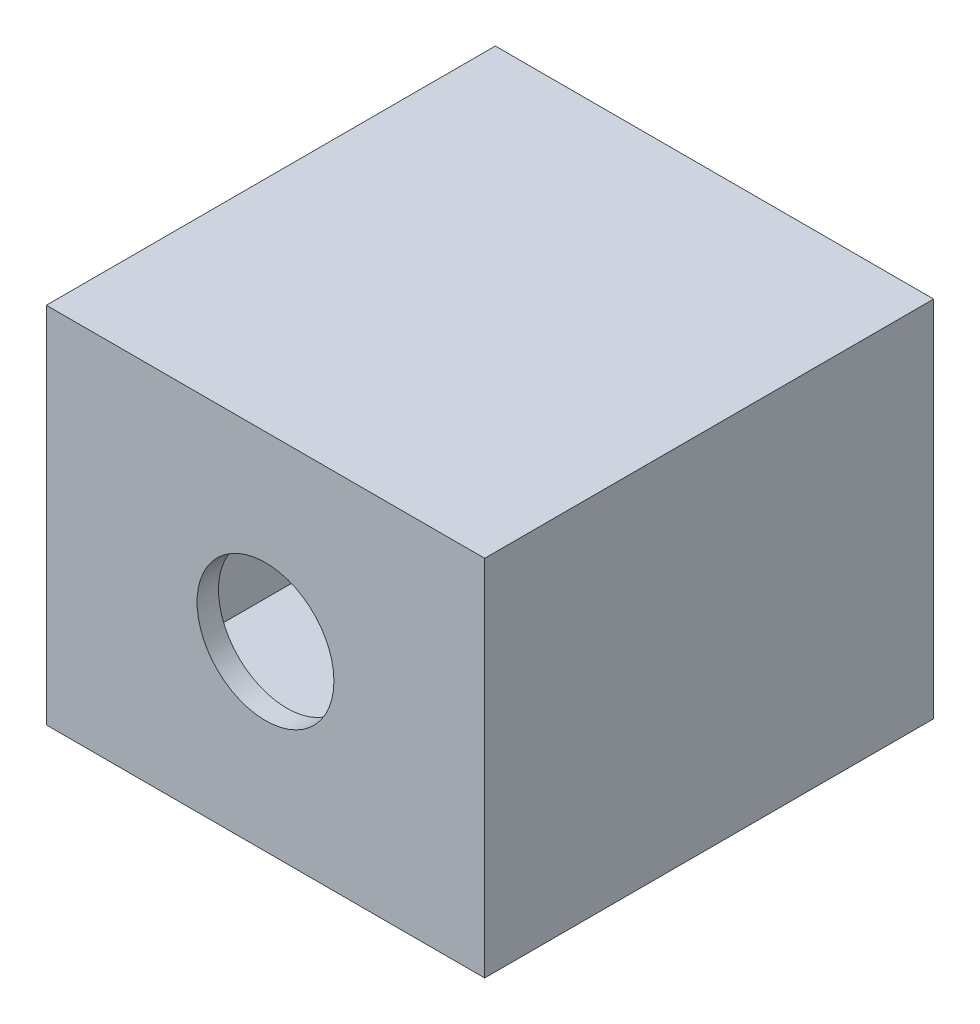
ISO-10303-21;
HEADER;
FILE_DESCRIPTION(('STEP AP214'),'2;1');
FILE_NAME('part.step','',(''),(''),'','','');
FILE_SCHEMA(('AUTOMOTIVE_DESIGN { 1 0 10303 214 1 1 1 1 }'));
ENDSEC;
DATA;
#1=APPLICATION_CONTEXT('core data for automotive mechanical design processes');
#2=APPLICATION_PROTOCOL_DEFINITION('international standard','automotive_design',2000,#1);
#3=PRODUCT_CONTEXT('',#1,'mechanical');
#4=PRODUCT('Part','Part','',(#3));
#5=PRODUCT_RELATED_PRODUCT_CATEGORY('part','',(#4));
#6=PRODUCT_DEFINITION_FORMATION('','',#4);
#7=PRODUCT_DEFINITION_CONTEXT('part definition',#1,'design');
#8=PRODUCT_DEFINITION('design','',#6,#7);
#9=PRODUCT_DEFINITION_SHAPE('','',#8);
#10=(LENGTH_UNIT() NAMED_UNIT(*) SI_UNIT(.MILLI.,.METRE.));
#11=(NAMED_UNIT(*) PLANE_ANGLE_UNIT() SI_UNIT($,.RADIAN.));
#12=(NAMED_UNIT(*) SI_UNIT($,.STERADIAN.) SOLID_ANGLE_UNIT());
#13=UNCERTAINTY_MEASURE_WITH_UNIT(LENGTH_MEASURE(1.E-05),#10,'distance_accuracy_value','');
#14=(GEOMETRIC_REPRESENTATION_CONTEXT(3) GLOBAL_UNCERTAINTY_ASSIGNED_CONTEXT((#13)) GLOBAL_UNIT_ASSIGNED_CONTEXT((#10,
#11,#12)) REPRESENTATION_CONTEXT('',''));
#15=CARTESIAN_POINT('',(0.,0.,0.));
#16=DIRECTION('',(0.,0.,1.));
#17=DIRECTION('',(1.,0.,0.));
#18=AXIS2_PLACEMENT_3D('',#15,#16,#17);
#19=CARTESIAN_POINT('',(0.,0.,0.));
#20=DIRECTION('',(0.,0.,1.));
#21=DIRECTION('',(1.,0.,0.));
#22=AXIS2_PLACEMENT_3D('',#19,#20,#21);
#23=PLANE('',#22);
#24=DIRECTION('',(0.,-1.,0.));
#25=VECTOR('',#24,1.);
#26=CARTESIAN_POINT('',(-50.0512204159946,12.5345616141394,0.));
#27=LINE('',#26,#25);
#28=CARTESIAN_POINT('',(-50.0512204159946,12.5345616141394,0.));
#29=VERTEX_POINT('',#28);
#30=CARTESIAN_POINT('',(-50.0512204159946,-4.46543838586062,0.));
#31=VERTEX_POINT('',#30);
#32=EDGE_CURVE('E105',#29,#31,#27,.T.);
#33=ORIENTED_EDGE('',*,*,#32,.F.);
#34=DIRECTION('',(-1.,0.,0.));
#35=VECTOR('',#34,1.);
#36=CARTESIAN_POINT('',(-50.0512204159946,12.5345616141394,0.));
#37=LINE('',#36,#35);
#38=CARTESIAN_POINT('',(-29.5512204159946,12.5345616141394,0.));
#39=VERTEX_POINT('',#38);
#40=EDGE_CURVE('E56',#39,#29,#37,.T.);
#41=ORIENTED_EDGE('',*,*,#40,.F.);
#42=DIRECTION('',(0.,1.,0.));
#43=VECTOR('',#42,1.);
#44=CARTESIAN_POINT('',(-29.5512204159946,12.5345616141394,0.));
#45=LINE('',#44,#43);
#46=CARTESIAN_POINT('',(-29.5512204159946,-4.46543838586062,0.));
#47=VERTEX_POINT('',#46);
#48=EDGE_CURVE('E163',#47,#39,#45,.T.);
#49=ORIENTED_EDGE('',*,*,#48,.F.);
#50=DIRECTION('',(1.,0.,0.));
#51=VECTOR('',#50,1.);
#52=CARTESIAN_POINT('',(-50.0512204159946,-4.46543838586062,0.));
#53=LINE('',#52,#51);
#54=EDGE_CURVE('E161',#31,#47,#53,.T.);
#55=ORIENTED_EDGE('',*,*,#54,.F.);
#56=EDGE_LOOP('',(#33,#41,#49,#55));
#57=FACE_BOUND('',#56,.T.);
#58=DIRECTION('',(0.,-1.,0.));
#59=VECTOR('',#58,1.);
#60=CARTESIAN_POINT('',(-49.0512204159946,11.5345616141394,0.));
#61=LINE('',#60,#59);
#62=CARTESIAN_POINT('',(-49.0512204159946,11.5345616141394,0.));
#63=VERTEX_POINT('',#62);
#64=CARTESIAN_POINT('',(-49.0512204159946,-3.46543838586062,0.));
#65=VERTEX_POINT('',#64);
#66=EDGE_CURVE('E48',#63,#65,#61,.T.);
#67=ORIENTED_EDGE('',*,*,#66,.T.);
#68=DIRECTION('',(1.,0.,0.));
#69=VECTOR('',#68,1.);
#70=CARTESIAN_POINT('',(-49.0512204159946,-3.46543838586062,0.));
#71=LINE('',#70,#69);
#72=CARTESIAN_POINT('',(-30.5512204159946,-3.46543838586062,0.));
#73=VERTEX_POINT('',#72);
#74=EDGE_CURVE('E145',#65,#73,#71,.T.);
#75=ORIENTED_EDGE('',*,*,#74,.T.);
#76=DIRECTION('',(0.,1.,0.));
#77=VECTOR('',#76,1.);
#78=CARTESIAN_POINT('',(-30.5512204159946,11.5345616141394,0.));
#79=LINE('',#78,#77);
#80=CARTESIAN_POINT('',(-30.5512204159946,11.5345616141394,0.));
#81=VERTEX_POINT('',#80);
#82=EDGE_CURVE('E148',#73,#81,#79,.T.);
#83=ORIENTED_EDGE('',*,*,#82,.T.);
#84=DIRECTION('',(-1.,0.,0.));
#85=VECTOR('',#84,1.);
#86=CARTESIAN_POINT('',(-49.0512204159946,11.5345616141394,0.));
#87=LINE('',#86,#85);
#88=EDGE_CURVE('E134',#81,#63,#87,.T.);
#89=ORIENTED_EDGE('',*,*,#88,.T.);
#90=EDGE_LOOP('',(#67,#75,#83,#89));
#91=FACE_BOUND('',#90,.T.);
#92=ADVANCED_FACE('F33',(#57,#91),#23,.F.);
#93=CARTESIAN_POINT('',(-50.0512204159946,12.5345616141394,20.));
#94=DIRECTION('',(1.,0.,0.));
#95=DIRECTION('',(0.,0.,-1.));
#96=AXIS2_PLACEMENT_3D('',#93,#94,#95);
#97=PLANE('',#96);
#98=ORIENTED_EDGE('',*,*,#32,.T.);
#99=DIRECTION('',(0.,0.,-1.));
#100=VECTOR('',#99,1.);
#101=CARTESIAN_POINT('',(-50.0512204159946,-4.46543838586062,20.));
#102=LINE('',#101,#100);
#103=CARTESIAN_POINT('',(-50.0512204159946,-4.46543838586062,21.));
#104=VERTEX_POINT('',#103);
#105=EDGE_CURVE('E11',#104,#31,#102,.T.);
#106=ORIENTED_EDGE('',*,*,#105,.F.);
#107=DIRECTION('',(0.,-1.,0.));
#108=VECTOR('',#107,1.);
#109=CARTESIAN_POINT('',(-50.0512204159946,12.5345616141394,21.));
#110=LINE('',#109,#108);
#111=CARTESIAN_POINT('',(-50.0512204159946,12.5345616141394,21.));
#112=VERTEX_POINT('',#111);
#113=EDGE_CURVE('E103',#112,#104,#110,.T.);
#114=ORIENTED_EDGE('',*,*,#113,.F.);
#115=DIRECTION('',(0.,0.,-1.));
#116=VECTOR('',#115,1.);
#117=CARTESIAN_POINT('',(-50.0512204159946,12.5345616141394,20.));
#118=LINE('',#117,#116);
#119=EDGE_CURVE('E166',#112,#29,#118,.T.);
#120=ORIENTED_EDGE('',*,*,#119,.T.);
#121=EDGE_LOOP('',(#98,#106,#114,#120));
#122=FACE_BOUND('',#121,.T.);
#123=ADVANCED_FACE('F35',(#122),#97,.F.);
#124=CARTESIAN_POINT('',(-50.0512204159946,-4.46543838586062,20.));
#125=DIRECTION('',(0.,1.,0.));
#126=DIRECTION('',(0.,0.,1.));
#127=AXIS2_PLACEMENT_3D('',#124,#125,#126);
#128=PLANE('',#127);
#129=ORIENTED_EDGE('',*,*,#54,.T.);
#130=DIRECTION('',(0.,0.,-1.));
#131=VECTOR('',#130,1.);
#132=CARTESIAN_POINT('',(-29.5512204159946,-4.46543838586062,20.));
#133=LINE('',#132,#131);
#134=CARTESIAN_POINT('',(-29.5512204159946,-4.46543838586062,21.));
#135=VERTEX_POINT('',#134);
#136=EDGE_CURVE('E41',#135,#47,#133,.T.);
#137=ORIENTED_EDGE('',*,*,#136,.F.);
#138=DIRECTION('',(1.,0.,0.));
#139=VECTOR('',#138,1.);
#140=CARTESIAN_POINT('',(-50.0512204159946,-4.46543838586062,21.));
#141=LINE('',#140,#139);
#142=EDGE_CURVE('E108',#104,#135,#141,.T.);
#143=ORIENTED_EDGE('',*,*,#142,.F.);
#144=ORIENTED_EDGE('',*,*,#105,.T.);
#145=EDGE_LOOP('',(#129,#137,#143,#144));
#146=FACE_BOUND('',#145,.T.);
#147=ADVANCED_FACE('F109',(#146),#128,.F.);
#148=CARTESIAN_POINT('',(-29.5512204159946,12.5345616141394,20.));
#149=DIRECTION('',(-1.,0.,0.));
#150=DIRECTION('',(0.,-1.,0.));
#151=AXIS2_PLACEMENT_3D('',#148,#149,#150);
#152=PLANE('',#151);
#153=ORIENTED_EDGE('',*,*,#48,.T.);
#154=DIRECTION('',(0.,0.,-1.));
#155=VECTOR('',#154,1.);
#156=CARTESIAN_POINT('',(-29.5512204159946,12.5345616141394,20.));
#157=LINE('',#156,#155);
#158=CARTESIAN_POINT('',(-29.5512204159946,12.5345616141394,21.));
#159=VERTEX_POINT('',#158);
#160=EDGE_CURVE('E168',#159,#39,#157,.T.);
#161=ORIENTED_EDGE('',*,*,#160,.F.);
#162=DIRECTION('',(0.,1.,0.));
#163=VECTOR('',#162,1.);
#164=CARTESIAN_POINT('',(-29.5512204159946,12.5345616141394,21.));
#165=LINE('',#164,#163);
#166=EDGE_CURVE('E114',#135,#159,#165,.T.);
#167=ORIENTED_EDGE('',*,*,#166,.F.);
#168=ORIENTED_EDGE('',*,*,#136,.T.);
#169=EDGE_LOOP('',(#153,#161,#167,#168));
#170=FACE_BOUND('',#169,.T.);
#171=ADVANCED_FACE('F171',(#170),#152,.F.);
#172=CARTESIAN_POINT('',(-50.0512204159946,12.5345616141394,20.));
#173=DIRECTION('',(0.,-1.,0.));
#174=DIRECTION('',(1.,0.,0.));
#175=AXIS2_PLACEMENT_3D('',#172,#173,#174);
#176=PLANE('',#175);
#177=ORIENTED_EDGE('',*,*,#40,.T.);
#178=ORIENTED_EDGE('',*,*,#119,.F.);
#179=DIRECTION('',(-1.,0.,0.));
#180=VECTOR('',#179,1.);
#181=CARTESIAN_POINT('',(-50.0512204159946,12.5345616141394,21.));
#182=LINE('',#181,#180);
#183=EDGE_CURVE('E120',#159,#112,#182,.T.);
#184=ORIENTED_EDGE('',*,*,#183,.F.);
#185=ORIENTED_EDGE('',*,*,#160,.T.);
#186=EDGE_LOOP('',(#177,#178,#184,#185));
#187=FACE_BOUND('',#186,.T.);
#188=ADVANCED_FACE('F212',(#187),#176,.F.);
#189=CARTESIAN_POINT('',(-49.0512204159946,11.5345616141394,20.));
#190=DIRECTION('',(1.,0.,0.));
#191=DIRECTION('',(0.,0.,-1.));
#192=AXIS2_PLACEMENT_3D('',#189,#190,#191);
#193=PLANE('',#192);
#194=ORIENTED_EDGE('',*,*,#66,.F.);
#195=DIRECTION('',(0.,0.,-1.));
#196=VECTOR('',#195,1.);
#197=CARTESIAN_POINT('',(-49.0512204159946,11.5345616141394,20.));
#198=LINE('',#197,#196);
#199=CARTESIAN_POINT('',(-49.0512204159946,11.5345616141394,20.));
#200=VERTEX_POINT('',#199);
#201=EDGE_CURVE('E143',#200,#63,#198,.T.);
#202=ORIENTED_EDGE('',*,*,#201,.F.);
#203=DIRECTION('',(0.,-1.,0.));
#204=VECTOR('',#203,1.);
#205=CARTESIAN_POINT('',(-49.0512204159946,11.5345616141394,20.));
#206=LINE('',#205,#204);
#207=CARTESIAN_POINT('',(-49.0512204159946,-3.46543838586062,20.));
#208=VERTEX_POINT('',#207);
#209=EDGE_CURVE('E130',#200,#208,#206,.T.);
#210=ORIENTED_EDGE('',*,*,#209,.T.);
#211=DIRECTION('',(0.,0.,-1.));
#212=VECTOR('',#211,1.);
#213=CARTESIAN_POINT('',(-49.0512204159946,-3.46543838586062,20.));
#214=LINE('',#213,#212);
#215=EDGE_CURVE('E158',#208,#65,#214,.T.);
#216=ORIENTED_EDGE('',*,*,#215,.T.);
#217=EDGE_LOOP('',(#194,#202,#210,#216));
#218=FACE_BOUND('',#217,.T.);
#219=ADVANCED_FACE('F181',(#218),#193,.T.);
#220=CARTESIAN_POINT('',(-49.0512204159946,-3.46543838586062,20.));
#221=DIRECTION('',(0.,1.,0.));
#222=DIRECTION('',(-1.,0.,0.));
#223=AXIS2_PLACEMENT_3D('',#220,#221,#222);
#224=PLANE('',#223);
#225=ORIENTED_EDGE('',*,*,#74,.F.);
#226=ORIENTED_EDGE('',*,*,#215,.F.);
#227=DIRECTION('',(1.,0.,0.));
#228=VECTOR('',#227,1.);
#229=CARTESIAN_POINT('',(-49.0512204159946,-3.46543838586062,20.));
#230=LINE('',#229,#228);
#231=CARTESIAN_POINT('',(-30.5512204159946,-3.46543838586062,20.));
#232=VERTEX_POINT('',#231);
#233=EDGE_CURVE('E133',#208,#232,#230,.T.);
#234=ORIENTED_EDGE('',*,*,#233,.T.);
#235=DIRECTION('',(0.,0.,-1.));
#236=VECTOR('',#235,1.);
#237=CARTESIAN_POINT('',(-30.5512204159946,-3.46543838586062,20.));
#238=LINE('',#237,#236);
#239=EDGE_CURVE('E156',#232,#73,#238,.T.);
#240=ORIENTED_EDGE('',*,*,#239,.T.);
#241=EDGE_LOOP('',(#225,#226,#234,#240));
#242=FACE_BOUND('',#241,.T.);
#243=ADVANCED_FACE('F185',(#242),#224,.T.);
#244=CARTESIAN_POINT('',(-30.5512204159946,11.5345616141394,20.));
#245=DIRECTION('',(-1.,0.,0.));
#246=DIRECTION('',(0.,-1.,0.));
#247=AXIS2_PLACEMENT_3D('',#244,#245,#246);
#248=PLANE('',#247);
#249=ORIENTED_EDGE('',*,*,#82,.F.);
#250=ORIENTED_EDGE('',*,*,#239,.F.);
#251=DIRECTION('',(0.,1.,0.));
#252=VECTOR('',#251,1.);
#253=CARTESIAN_POINT('',(-30.5512204159946,11.5345616141394,20.));
#254=LINE('',#253,#252);
#255=CARTESIAN_POINT('',(-30.5512204159946,11.5345616141394,20.));
#256=VERTEX_POINT('',#255);
#257=EDGE_CURVE('E137',#232,#256,#254,.T.);
#258=ORIENTED_EDGE('',*,*,#257,.T.);
#259=DIRECTION('',(0.,0.,-1.));
#260=VECTOR('',#259,1.);
#261=CARTESIAN_POINT('',(-30.5512204159946,11.5345616141394,20.));
#262=LINE('',#261,#260);
#263=EDGE_CURVE('E154',#256,#81,#262,.T.);
#264=ORIENTED_EDGE('',*,*,#263,.T.);
#265=EDGE_LOOP('',(#249,#250,#258,#264));
#266=FACE_BOUND('',#265,.T.);
#267=ADVANCED_FACE('F188',(#266),#248,.T.);
#268=CARTESIAN_POINT('',(-49.0512204159946,11.5345616141394,20.));
#269=DIRECTION('',(0.,-1.,0.));
#270=DIRECTION('',(1.,0.,0.));
#271=AXIS2_PLACEMENT_3D('',#268,#269,#270);
#272=PLANE('',#271);
#273=ORIENTED_EDGE('',*,*,#88,.F.);
#274=ORIENTED_EDGE('',*,*,#263,.F.);
#275=DIRECTION('',(-1.,0.,0.));
#276=VECTOR('',#275,1.);
#277=CARTESIAN_POINT('',(-49.0512204159946,11.5345616141394,20.));
#278=LINE('',#277,#276);
#279=EDGE_CURVE('E140',#256,#200,#278,.T.);
#280=ORIENTED_EDGE('',*,*,#279,.T.);
#281=ORIENTED_EDGE('',*,*,#201,.T.);
#282=EDGE_LOOP('',(#273,#274,#280,#281));
#283=FACE_BOUND('',#282,.T.);
#284=ADVANCED_FACE('F180',(#283),#272,.T.);
#285=CARTESIAN_POINT('',(0.,0.,21.));
#286=DIRECTION('',(0.,0.,1.));
#287=DIRECTION('',(1.,0.,0.));
#288=AXIS2_PLACEMENT_3D('',#285,#286,#287);
#289=PLANE('',#288);
#290=ORIENTED_EDGE('',*,*,#113,.T.);
#291=ORIENTED_EDGE('',*,*,#142,.T.);
#292=ORIENTED_EDGE('',*,*,#166,.T.);
#293=ORIENTED_EDGE('',*,*,#183,.T.);
#294=EDGE_LOOP('',(#290,#291,#292,#293));
#295=FACE_BOUND('',#294,.T.);
#296=CARTESIAN_POINT('',(-39.8012204159946,4.03456161413938,21.));
#297=DIRECTION('',(0.,0.,1.));
#298=DIRECTION('',(1.,0.,0.));
#299=AXIS2_PLACEMENT_3D('',#296,#297,#298);
#300=CIRCLE('',#299,3.2);
#301=CARTESIAN_POINT('',(-36.6012204159946,4.03456161413938,21.));
#302=VERTEX_POINT('',#301);
#303=EDGE_CURVE('E121',#302,#302,#300,.T.);
#304=ORIENTED_EDGE('',*,*,#303,.F.);
#305=EDGE_LOOP('',(#304));
#306=FACE_BOUND('',#305,.T.);
#307=ADVANCED_FACE('F117',(#295,#306),#289,.T.);
#308=CARTESIAN_POINT('',(0.,0.,20.));
#309=DIRECTION('',(0.,0.,1.));
#310=DIRECTION('',(1.,0.,0.));
#311=AXIS2_PLACEMENT_3D('',#308,#309,#310);
#312=PLANE('',#311);
#313=ORIENTED_EDGE('',*,*,#209,.F.);
#314=ORIENTED_EDGE('',*,*,#279,.F.);
#315=ORIENTED_EDGE('',*,*,#257,.F.);
#316=ORIENTED_EDGE('',*,*,#233,.F.);
#317=EDGE_LOOP('',(#313,#314,#315,#316));
#318=FACE_BOUND('',#317,.T.);
#319=CARTESIAN_POINT('',(-39.8012204159946,4.03456161413938,20.));
#320=DIRECTION('',(0.,0.,1.));
#321=DIRECTION('',(1.,0.,0.));
#322=AXIS2_PLACEMENT_3D('',#319,#320,#321);
#323=CIRCLE('',#322,3.2);
#324=CARTESIAN_POINT('',(-36.6012204159946,4.03456161413938,20.));
#325=VERTEX_POINT('',#324);
#326=EDGE_CURVE('E124',#325,#325,#323,.T.);
#327=ORIENTED_EDGE('',*,*,#326,.T.);
#328=EDGE_LOOP('',(#327));
#329=FACE_BOUND('',#328,.T.);
#330=ADVANCED_FACE('F189',(#318,#329),#312,.F.);
#331=CARTESIAN_POINT('',(-39.8012204159946,4.03456161413938,21.));
#332=DIRECTION('',(0.,0.,-1.));
#333=DIRECTION('',(-1.,0.,0.));
#334=AXIS2_PLACEMENT_3D('',#331,#332,#333);
#335=CYLINDRICAL_SURFACE('',#334,3.2);
#336=ORIENTED_EDGE('',*,*,#303,.T.);
#337=EDGE_LOOP('',(#336));
#338=FACE_BOUND('',#337,.T.);
#339=ORIENTED_EDGE('',*,*,#326,.F.);
#340=EDGE_LOOP('',(#339));
#341=FACE_BOUND('',#340,.T.);
#342=ADVANCED_FACE('F192',(#338,#341),#335,.F.);
#343=CLOSED_SHELL('',(#92,#123,#147,#171,#188,#219,#243,#267,#284,#307,#330,#342));
#344=MANIFOLD_SOLID_BREP('B2',#343);
#345=ADVANCED_BREP_SHAPE_REPRESENTATION('',(#18,#344),#14);
#346=SHAPE_DEFINITION_REPRESENTATION(#9,#345);
ENDSEC;
END-ISO-10303-21;
